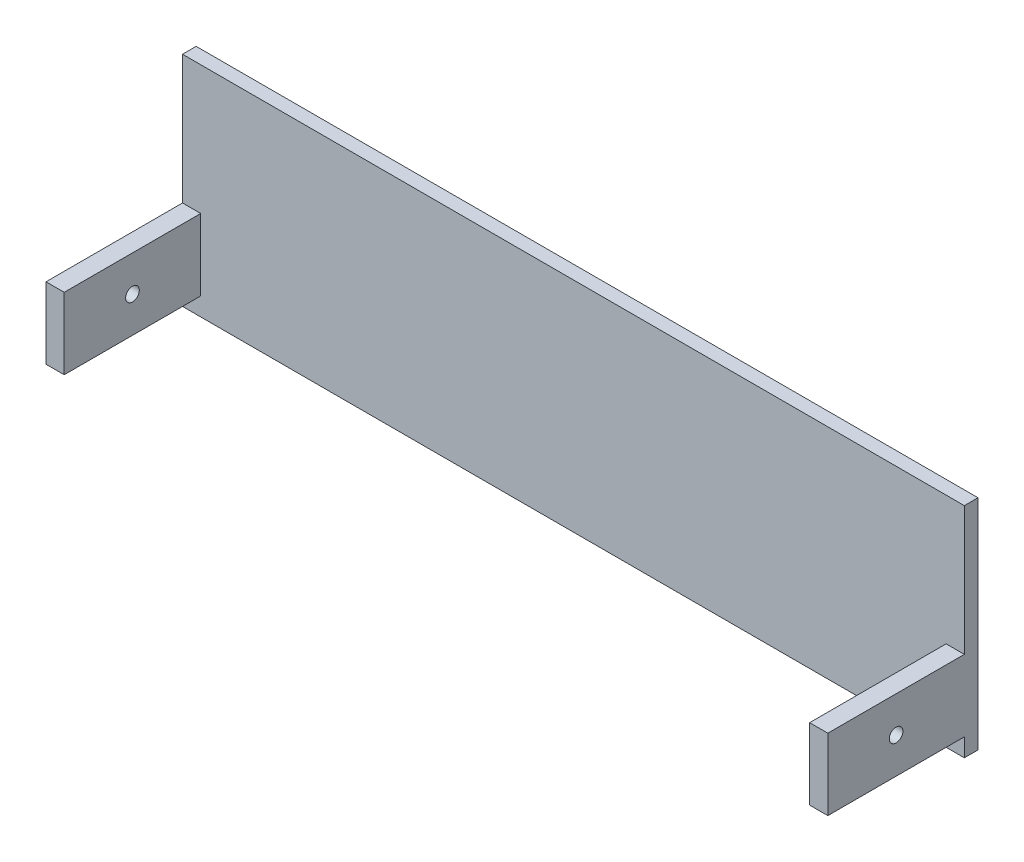
ISO-10303-21;
HEADER;
FILE_DESCRIPTION(('STEP AP214'),'2;1');
FILE_NAME('part.step','',(''),(''),'','','');
FILE_SCHEMA(('AUTOMOTIVE_DESIGN { 1 0 10303 214 1 1 1 1 }'));
ENDSEC;
DATA;
#1=APPLICATION_CONTEXT('core data for automotive mechanical design processes');
#2=APPLICATION_PROTOCOL_DEFINITION('international standard','automotive_design',2000,#1);
#3=PRODUCT_CONTEXT('',#1,'mechanical');
#4=PRODUCT('Part','Part','',(#3));
#5=PRODUCT_RELATED_PRODUCT_CATEGORY('part','',(#4));
#6=PRODUCT_DEFINITION_FORMATION('','',#4);
#7=PRODUCT_DEFINITION_CONTEXT('part definition',#1,'design');
#8=PRODUCT_DEFINITION('design','',#6,#7);
#9=PRODUCT_DEFINITION_SHAPE('','',#8);
#10=(LENGTH_UNIT() NAMED_UNIT(*) SI_UNIT(.MILLI.,.METRE.));
#11=(NAMED_UNIT(*) PLANE_ANGLE_UNIT() SI_UNIT($,.RADIAN.));
#12=(NAMED_UNIT(*) SI_UNIT($,.STERADIAN.) SOLID_ANGLE_UNIT());
#13=UNCERTAINTY_MEASURE_WITH_UNIT(LENGTH_MEASURE(1.E-05),#10,'distance_accuracy_value','');
#14=(GEOMETRIC_REPRESENTATION_CONTEXT(3) GLOBAL_UNCERTAINTY_ASSIGNED_CONTEXT((#13)) GLOBAL_UNIT_ASSIGNED_CONTEXT((#10,
#11,#12)) REPRESENTATION_CONTEXT('',''));
#15=CARTESIAN_POINT('',(0.,0.,0.));
#16=DIRECTION('',(0.,0.,1.));
#17=DIRECTION('',(1.,0.,0.));
#18=AXIS2_PLACEMENT_3D('',#15,#16,#17);
#19=CARTESIAN_POINT('',(0.,0.,3.));
#20=DIRECTION('',(0.,0.,1.));
#21=DIRECTION('',(1.,0.,0.));
#22=AXIS2_PLACEMENT_3D('',#19,#20,#21);
#23=PLANE('',#22);
#24=DIRECTION('',(0.,-1.,0.));
#25=VECTOR('',#24,1.);
#26=CARTESIAN_POINT('',(-4.,4.,3.));
#27=LINE('',#26,#25);
#28=CARTESIAN_POINT('',(-4.,19.6958737864084,3.));
#29=VERTEX_POINT('',#28);
#30=CARTESIAN_POINT('',(-4.,4.,3.));
#31=VERTEX_POINT('',#30);
#32=EDGE_CURVE('E139',#29,#31,#27,.T.);
#33=ORIENTED_EDGE('',*,*,#32,.F.);
#34=DIRECTION('',(-1.,0.,0.));
#35=VECTOR('',#34,1.);
#36=CARTESIAN_POINT('',(0.,19.6958737864084,3.));
#37=LINE('',#36,#35);
#38=CARTESIAN_POINT('',(0.,19.6958737864084,3.));
#39=VERTEX_POINT('',#38);
#40=EDGE_CURVE('E133',#39,#29,#37,.T.);
#41=ORIENTED_EDGE('',*,*,#40,.F.);
#42=DIRECTION('',(0.,-1.,0.));
#43=VECTOR('',#42,1.);
#44=CARTESIAN_POINT('',(0.,48.,3.));
#45=LINE('',#44,#43);
#46=CARTESIAN_POINT('',(0.,48.,3.));
#47=VERTEX_POINT('',#46);
#48=EDGE_CURVE('E136',#47,#39,#45,.T.);
#49=ORIENTED_EDGE('',*,*,#48,.F.);
#50=DIRECTION('',(-1.,0.,0.));
#51=VECTOR('',#50,1.);
#52=CARTESIAN_POINT('',(0.,48.,3.));
#53=LINE('',#52,#51);
#54=CARTESIAN_POINT('',(-171.8,48.,3.));
#55=VERTEX_POINT('',#54);
#56=EDGE_CURVE('E227',#47,#55,#53,.T.);
#57=ORIENTED_EDGE('',*,*,#56,.T.);
#58=DIRECTION('',(0.,-1.,0.));
#59=VECTOR('',#58,1.);
#60=CARTESIAN_POINT('',(-171.8,48.,3.));
#61=LINE('',#60,#59);
#62=CARTESIAN_POINT('',(-171.8,19.6958737864084,3.));
#63=VERTEX_POINT('',#62);
#64=EDGE_CURVE('E157',#55,#63,#61,.T.);
#65=ORIENTED_EDGE('',*,*,#64,.T.);
#66=CARTESIAN_POINT('',(-167.8,19.6958737864084,3.));
#67=VERTEX_POINT('',#66);
#68=EDGE_CURVE('E142',#67,#63,#37,.T.);
#69=ORIENTED_EDGE('',*,*,#68,.F.);
#70=DIRECTION('',(0.,1.,0.));
#71=VECTOR('',#70,1.);
#72=CARTESIAN_POINT('',(-167.8,4.,3.));
#73=LINE('',#72,#71);
#74=CARTESIAN_POINT('',(-167.8,4.,3.));
#75=VERTEX_POINT('',#74);
#76=EDGE_CURVE('E201',#75,#67,#73,.T.);
#77=ORIENTED_EDGE('',*,*,#76,.F.);
#78=DIRECTION('',(1.,0.,0.));
#79=VECTOR('',#78,1.);
#80=CARTESIAN_POINT('',(-171.8,4.,3.));
#81=LINE('',#80,#79);
#82=CARTESIAN_POINT('',(-171.8,4.,3.));
#83=VERTEX_POINT('',#82);
#84=EDGE_CURVE('E189',#83,#75,#81,.T.);
#85=ORIENTED_EDGE('',*,*,#84,.F.);
#86=DIRECTION('',(0.,-1.,0.));
#87=VECTOR('',#86,1.);
#88=CARTESIAN_POINT('',(-171.8,0.,3.));
#89=LINE('',#88,#87);
#90=CARTESIAN_POINT('',(-171.8,0.,3.));
#91=VERTEX_POINT('',#90);
#92=EDGE_CURVE('E231',#83,#91,#89,.T.);
#93=ORIENTED_EDGE('',*,*,#92,.T.);
#94=DIRECTION('',(1.,0.,0.));
#95=VECTOR('',#94,1.);
#96=CARTESIAN_POINT('',(0.,0.,3.));
#97=LINE('',#96,#95);
#98=CARTESIAN_POINT('',(0.,0.,3.));
#99=VERTEX_POINT('',#98);
#100=EDGE_CURVE('E234',#91,#99,#97,.T.);
#101=ORIENTED_EDGE('',*,*,#100,.T.);
#102=DIRECTION('',(0.,1.,0.));
#103=VECTOR('',#102,1.);
#104=CARTESIAN_POINT('',(0.,0.,3.));
#105=LINE('',#104,#103);
#106=CARTESIAN_POINT('',(0.,4.,3.));
#107=VERTEX_POINT('',#106);
#108=EDGE_CURVE('E223',#99,#107,#105,.T.);
#109=ORIENTED_EDGE('',*,*,#108,.T.);
#110=DIRECTION('',(1.,0.,0.));
#111=VECTOR('',#110,1.);
#112=CARTESIAN_POINT('',(0.,4.,3.));
#113=LINE('',#112,#111);
#114=EDGE_CURVE('E183',#31,#107,#113,.T.);
#115=ORIENTED_EDGE('',*,*,#114,.F.);
#116=EDGE_LOOP('',(#33,#41,#49,#57,#65,#69,#77,#85,#93,#101,#109,#115));
#117=FACE_BOUND('',#116,.T.);
#118=ADVANCED_FACE('F43',(#117),#23,.T.);
#119=CARTESIAN_POINT('',(0.,0.,3.));
#120=DIRECTION('',(-1.,0.,0.));
#121=DIRECTION('',(0.,0.,1.));
#122=AXIS2_PLACEMENT_3D('',#119,#120,#121);
#123=PLANE('',#122);
#124=CARTESIAN_POINT('',(0.,11.8479368932042,18.));
#125=DIRECTION('',(-1.,0.,0.));
#126=DIRECTION('',(0.,0.,1.));
#127=AXIS2_PLACEMENT_3D('',#124,#125,#126);
#128=CIRCLE('',#127,1.5);
#129=CARTESIAN_POINT('',(0.,11.8479368932042,19.5));
#130=VERTEX_POINT('',#129);
#131=EDGE_CURVE('E450',#130,#130,#128,.T.);
#132=ORIENTED_EDGE('',*,*,#131,.T.);
#133=EDGE_LOOP('',(#132));
#134=FACE_BOUND('',#133,.T.);
#135=DIRECTION('',(0.,0.,-1.));
#136=VECTOR('',#135,1.);
#137=CARTESIAN_POINT('',(0.,48.,3.));
#138=LINE('',#137,#136);
#139=CARTESIAN_POINT('',(0.,48.,0.));
#140=VERTEX_POINT('',#139);
#141=EDGE_CURVE('E11',#47,#140,#138,.T.);
#142=ORIENTED_EDGE('',*,*,#141,.F.);
#143=ORIENTED_EDGE('',*,*,#48,.T.);
#144=DIRECTION('',(0.,0.,1.));
#145=VECTOR('',#144,1.);
#146=CARTESIAN_POINT('',(0.,19.6958737864084,33.));
#147=LINE('',#146,#145);
#148=CARTESIAN_POINT('',(0.,19.6958737864084,33.));
#149=VERTEX_POINT('',#148);
#150=EDGE_CURVE('E145',#39,#149,#147,.T.);
#151=ORIENTED_EDGE('',*,*,#150,.T.);
#152=DIRECTION('',(0.,1.,0.));
#153=VECTOR('',#152,1.);
#154=CARTESIAN_POINT('',(0.,4.,33.));
#155=LINE('',#154,#153);
#156=CARTESIAN_POINT('',(0.,4.,33.));
#157=VERTEX_POINT('',#156);
#158=EDGE_CURVE('E186',#157,#149,#155,.T.);
#159=ORIENTED_EDGE('',*,*,#158,.F.);
#160=DIRECTION('',(0.,0.,-1.));
#161=VECTOR('',#160,1.);
#162=CARTESIAN_POINT('',(0.,4.,33.));
#163=LINE('',#162,#161);
#164=EDGE_CURVE('E178',#157,#107,#163,.T.);
#165=ORIENTED_EDGE('',*,*,#164,.T.);
#166=ORIENTED_EDGE('',*,*,#108,.F.);
#167=DIRECTION('',(0.,0.,-1.));
#168=VECTOR('',#167,1.);
#169=CARTESIAN_POINT('',(0.,0.,3.));
#170=LINE('',#169,#168);
#171=CARTESIAN_POINT('',(0.,0.,0.));
#172=VERTEX_POINT('',#171);
#173=EDGE_CURVE('E237',#99,#172,#170,.T.);
#174=ORIENTED_EDGE('',*,*,#173,.T.);
#175=DIRECTION('',(0.,1.,0.));
#176=VECTOR('',#175,1.);
#177=CARTESIAN_POINT('',(0.,0.,0.));
#178=LINE('',#177,#176);
#179=EDGE_CURVE('E222',#172,#140,#178,.T.);
#180=ORIENTED_EDGE('',*,*,#179,.T.);
#181=EDGE_LOOP('',(#142,#143,#151,#159,#165,#166,#174,#180));
#182=FACE_BOUND('',#181,.T.);
#183=ADVANCED_FACE('F45',(#134,#182),#123,.F.);
#184=CARTESIAN_POINT('',(0.,48.,3.));
#185=DIRECTION('',(0.,-1.,0.));
#186=DIRECTION('',(1.,0.,0.));
#187=AXIS2_PLACEMENT_3D('',#184,#185,#186);
#188=PLANE('',#187);
#189=DIRECTION('',(0.,0.,-1.));
#190=VECTOR('',#189,1.);
#191=CARTESIAN_POINT('',(-171.8,48.,3.));
#192=LINE('',#191,#190);
#193=CARTESIAN_POINT('',(-171.8,48.,0.));
#194=VERTEX_POINT('',#193);
#195=EDGE_CURVE('E53',#55,#194,#192,.T.);
#196=ORIENTED_EDGE('',*,*,#195,.F.);
#197=ORIENTED_EDGE('',*,*,#56,.F.);
#198=ORIENTED_EDGE('',*,*,#141,.T.);
#199=DIRECTION('',(-1.,0.,0.));
#200=VECTOR('',#199,1.);
#201=CARTESIAN_POINT('',(0.,48.,0.));
#202=LINE('',#201,#200);
#203=EDGE_CURVE('E240',#140,#194,#202,.T.);
#204=ORIENTED_EDGE('',*,*,#203,.T.);
#205=EDGE_LOOP('',(#196,#197,#198,#204));
#206=FACE_BOUND('',#205,.T.);
#207=ADVANCED_FACE('F265',(#206),#188,.F.);
#208=CARTESIAN_POINT('',(-171.8,0.,3.));
#209=DIRECTION('',(1.,0.,0.));
#210=DIRECTION('',(0.,0.,-1.));
#211=AXIS2_PLACEMENT_3D('',#208,#209,#210);
#212=PLANE('',#211);
#213=CARTESIAN_POINT('',(-171.8,11.8479368932042,18.));
#214=DIRECTION('',(-1.,0.,0.));
#215=DIRECTION('',(0.,0.,1.));
#216=AXIS2_PLACEMENT_3D('',#213,#214,#215);
#217=CIRCLE('',#216,1.5);
#218=CARTESIAN_POINT('',(-171.8,11.8479368932042,19.5));
#219=VERTEX_POINT('',#218);
#220=EDGE_CURVE('E454',#219,#219,#217,.T.);
#221=ORIENTED_EDGE('',*,*,#220,.F.);
#222=EDGE_LOOP('',(#221));
#223=FACE_BOUND('',#222,.T.);
#224=DIRECTION('',(0.,0.,1.));
#225=VECTOR('',#224,1.);
#226=CARTESIAN_POINT('',(-171.8,19.6958737864084,33.));
#227=LINE('',#226,#225);
#228=CARTESIAN_POINT('',(-171.8,19.6958737864084,33.));
#229=VERTEX_POINT('',#228);
#230=EDGE_CURVE('E60',#63,#229,#227,.T.);
#231=ORIENTED_EDGE('',*,*,#230,.F.);
#232=ORIENTED_EDGE('',*,*,#64,.F.);
#233=ORIENTED_EDGE('',*,*,#195,.T.);
#234=DIRECTION('',(0.,-1.,0.));
#235=VECTOR('',#234,1.);
#236=CARTESIAN_POINT('',(-171.8,0.,0.));
#237=LINE('',#236,#235);
#238=CARTESIAN_POINT('',(-171.8,0.,0.));
#239=VERTEX_POINT('',#238);
#240=EDGE_CURVE('E244',#194,#239,#237,.T.);
#241=ORIENTED_EDGE('',*,*,#240,.T.);
#242=DIRECTION('',(0.,0.,-1.));
#243=VECTOR('',#242,1.);
#244=CARTESIAN_POINT('',(-171.8,0.,3.));
#245=LINE('',#244,#243);
#246=EDGE_CURVE('E252',#91,#239,#245,.T.);
#247=ORIENTED_EDGE('',*,*,#246,.F.);
#248=ORIENTED_EDGE('',*,*,#92,.F.);
#249=DIRECTION('',(0.,0.,-1.));
#250=VECTOR('',#249,1.);
#251=CARTESIAN_POINT('',(-171.8,4.,33.));
#252=LINE('',#251,#250);
#253=CARTESIAN_POINT('',(-171.8,4.,33.));
#254=VERTEX_POINT('',#253);
#255=EDGE_CURVE('E218',#254,#83,#252,.T.);
#256=ORIENTED_EDGE('',*,*,#255,.F.);
#257=DIRECTION('',(0.,-1.,0.));
#258=VECTOR('',#257,1.);
#259=CARTESIAN_POINT('',(-171.8,4.,33.));
#260=LINE('',#259,#258);
#261=EDGE_CURVE('E197',#229,#254,#260,.T.);
#262=ORIENTED_EDGE('',*,*,#261,.F.);
#263=EDGE_LOOP('',(#231,#232,#233,#241,#247,#248,#256,#262));
#264=FACE_BOUND('',#263,.T.);
#265=ADVANCED_FACE('F260',(#223,#264),#212,.F.);
#266=CARTESIAN_POINT('',(0.,0.,3.));
#267=DIRECTION('',(0.,1.,0.));
#268=DIRECTION('',(0.,0.,1.));
#269=AXIS2_PLACEMENT_3D('',#266,#267,#268);
#270=PLANE('',#269);
#271=DIRECTION('',(1.,0.,0.));
#272=VECTOR('',#271,1.);
#273=CARTESIAN_POINT('',(0.,0.,0.));
#274=LINE('',#273,#272);
#275=EDGE_CURVE('E228',#239,#172,#274,.T.);
#276=ORIENTED_EDGE('',*,*,#275,.T.);
#277=ORIENTED_EDGE('',*,*,#173,.F.);
#278=ORIENTED_EDGE('',*,*,#100,.F.);
#279=ORIENTED_EDGE('',*,*,#246,.T.);
#280=EDGE_LOOP('',(#276,#277,#278,#279));
#281=FACE_BOUND('',#280,.T.);
#282=ADVANCED_FACE('F272',(#281),#270,.F.);
#283=CARTESIAN_POINT('',(0.,0.,0.));
#284=DIRECTION('',(0.,0.,1.));
#285=DIRECTION('',(1.,0.,0.));
#286=AXIS2_PLACEMENT_3D('',#283,#284,#285);
#287=PLANE('',#286);
#288=ORIENTED_EDGE('',*,*,#179,.F.);
#289=ORIENTED_EDGE('',*,*,#275,.F.);
#290=ORIENTED_EDGE('',*,*,#240,.F.);
#291=ORIENTED_EDGE('',*,*,#203,.F.);
#292=EDGE_LOOP('',(#288,#289,#290,#291));
#293=FACE_BOUND('',#292,.T.);
#294=ADVANCED_FACE('F269',(#293),#287,.F.);
#295=CARTESIAN_POINT('',(-171.8,4.,33.));
#296=DIRECTION('',(0.,1.,0.));
#297=DIRECTION('',(-1.,0.,0.));
#298=AXIS2_PLACEMENT_3D('',#295,#296,#297);
#299=PLANE('',#298);
#300=ORIENTED_EDGE('',*,*,#84,.T.);
#301=DIRECTION('',(0.,0.,-1.));
#302=VECTOR('',#301,1.);
#303=CARTESIAN_POINT('',(-167.8,4.,33.));
#304=LINE('',#303,#302);
#305=CARTESIAN_POINT('',(-167.8,4.,33.));
#306=VERTEX_POINT('',#305);
#307=EDGE_CURVE('E208',#306,#75,#304,.T.);
#308=ORIENTED_EDGE('',*,*,#307,.F.);
#309=DIRECTION('',(1.,0.,0.));
#310=VECTOR('',#309,1.);
#311=CARTESIAN_POINT('',(-171.8,4.,33.));
#312=LINE('',#311,#310);
#313=EDGE_CURVE('E200',#254,#306,#312,.T.);
#314=ORIENTED_EDGE('',*,*,#313,.F.);
#315=ORIENTED_EDGE('',*,*,#255,.T.);
#316=EDGE_LOOP('',(#300,#308,#314,#315));
#317=FACE_BOUND('',#316,.T.);
#318=ADVANCED_FACE('F281',(#317),#299,.F.);
#319=CARTESIAN_POINT('',(-167.8,4.,33.));
#320=DIRECTION('',(-1.,0.,0.));
#321=DIRECTION('',(0.,0.,1.));
#322=AXIS2_PLACEMENT_3D('',#319,#320,#321);
#323=PLANE('',#322);
#324=CARTESIAN_POINT('',(-167.8,11.8479368932042,18.));
#325=DIRECTION('',(-1.,0.,0.));
#326=DIRECTION('',(0.,0.,1.));
#327=AXIS2_PLACEMENT_3D('',#324,#325,#326);
#328=CIRCLE('',#327,1.5);
#329=CARTESIAN_POINT('',(-167.8,11.8479368932042,19.5));
#330=VERTEX_POINT('',#329);
#331=EDGE_CURVE('E160',#330,#330,#328,.T.);
#332=ORIENTED_EDGE('',*,*,#331,.T.);
#333=EDGE_LOOP('',(#332));
#334=FACE_BOUND('',#333,.T.);
#335=ORIENTED_EDGE('',*,*,#76,.T.);
#336=DIRECTION('',(0.,0.,1.));
#337=VECTOR('',#336,1.);
#338=CARTESIAN_POINT('',(-167.8,19.6958737864084,33.));
#339=LINE('',#338,#337);
#340=CARTESIAN_POINT('',(-167.8,19.6958737864084,33.));
#341=VERTEX_POINT('',#340);
#342=EDGE_CURVE('E170',#67,#341,#339,.T.);
#343=ORIENTED_EDGE('',*,*,#342,.T.);
#344=DIRECTION('',(0.,1.,0.));
#345=VECTOR('',#344,1.);
#346=CARTESIAN_POINT('',(-167.8,4.,33.));
#347=LINE('',#346,#345);
#348=EDGE_CURVE('E204',#306,#341,#347,.T.);
#349=ORIENTED_EDGE('',*,*,#348,.F.);
#350=ORIENTED_EDGE('',*,*,#307,.T.);
#351=EDGE_LOOP('',(#335,#343,#349,#350));
#352=FACE_BOUND('',#351,.T.);
#353=ADVANCED_FACE('F291',(#334,#352),#323,.F.);
#354=CARTESIAN_POINT('',(0.,0.,33.));
#355=DIRECTION('',(0.,0.,-1.));
#356=DIRECTION('',(-1.,0.,0.));
#357=AXIS2_PLACEMENT_3D('',#354,#355,#356);
#358=PLANE('',#357);
#359=ORIENTED_EDGE('',*,*,#348,.T.);
#360=DIRECTION('',(-1.,0.,0.));
#361=VECTOR('',#360,1.);
#362=CARTESIAN_POINT('',(0.,19.6958737864084,33.));
#363=LINE('',#362,#361);
#364=EDGE_CURVE('E141',#341,#229,#363,.T.);
#365=ORIENTED_EDGE('',*,*,#364,.T.);
#366=ORIENTED_EDGE('',*,*,#261,.T.);
#367=ORIENTED_EDGE('',*,*,#313,.T.);
#368=EDGE_LOOP('',(#359,#365,#366,#367));
#369=FACE_BOUND('',#368,.T.);
#370=ADVANCED_FACE('F285',(#369),#358,.F.);
#371=CARTESIAN_POINT('',(-4.,4.,33.));
#372=DIRECTION('',(1.,0.,0.));
#373=DIRECTION('',(0.,0.,-1.));
#374=AXIS2_PLACEMENT_3D('',#371,#372,#373);
#375=PLANE('',#374);
#376=CARTESIAN_POINT('',(-4.,11.8479368932042,18.));
#377=DIRECTION('',(1.,0.,0.));
#378=DIRECTION('',(0.,0.,-1.));
#379=AXIS2_PLACEMENT_3D('',#376,#377,#378);
#380=CIRCLE('',#379,1.5);
#381=CARTESIAN_POINT('',(-4.,11.8479368932042,16.5));
#382=VERTEX_POINT('',#381);
#383=EDGE_CURVE('E47',#382,#382,#380,.T.);
#384=ORIENTED_EDGE('',*,*,#383,.T.);
#385=EDGE_LOOP('',(#384));
#386=FACE_BOUND('',#385,.T.);
#387=DIRECTION('',(0.,-1.,0.));
#388=VECTOR('',#387,1.);
#389=CARTESIAN_POINT('',(-4.,4.,33.));
#390=LINE('',#389,#388);
#391=CARTESIAN_POINT('',(-4.,19.6958737864084,33.));
#392=VERTEX_POINT('',#391);
#393=CARTESIAN_POINT('',(-4.,4.,33.));
#394=VERTEX_POINT('',#393);
#395=EDGE_CURVE('E192',#392,#394,#390,.T.);
#396=ORIENTED_EDGE('',*,*,#395,.F.);
#397=DIRECTION('',(0.,0.,-1.));
#398=VECTOR('',#397,1.);
#399=CARTESIAN_POINT('',(-4.,19.6958737864084,33.));
#400=LINE('',#399,#398);
#401=EDGE_CURVE('E68',#392,#29,#400,.T.);
#402=ORIENTED_EDGE('',*,*,#401,.T.);
#403=ORIENTED_EDGE('',*,*,#32,.T.);
#404=DIRECTION('',(0.,0.,-1.));
#405=VECTOR('',#404,1.);
#406=CARTESIAN_POINT('',(-4.,4.,33.));
#407=LINE('',#406,#405);
#408=EDGE_CURVE('E174',#394,#31,#407,.T.);
#409=ORIENTED_EDGE('',*,*,#408,.F.);
#410=EDGE_LOOP('',(#396,#402,#403,#409));
#411=FACE_BOUND('',#410,.T.);
#412=ADVANCED_FACE('F299',(#386,#411),#375,.F.);
#413=CARTESIAN_POINT('',(0.,4.,33.));
#414=DIRECTION('',(0.,1.,0.));
#415=DIRECTION('',(-1.,0.,0.));
#416=AXIS2_PLACEMENT_3D('',#413,#414,#415);
#417=PLANE('',#416);
#418=ORIENTED_EDGE('',*,*,#114,.T.);
#419=ORIENTED_EDGE('',*,*,#164,.F.);
#420=DIRECTION('',(1.,0.,0.));
#421=VECTOR('',#420,1.);
#422=CARTESIAN_POINT('',(0.,4.,33.));
#423=LINE('',#422,#421);
#424=EDGE_CURVE('E182',#394,#157,#423,.T.);
#425=ORIENTED_EDGE('',*,*,#424,.F.);
#426=ORIENTED_EDGE('',*,*,#408,.T.);
#427=EDGE_LOOP('',(#418,#419,#425,#426));
#428=FACE_BOUND('',#427,.T.);
#429=ADVANCED_FACE('F345',(#428),#417,.F.);
#430=CARTESIAN_POINT('',(0.,0.,33.));
#431=DIRECTION('',(0.,0.,1.));
#432=DIRECTION('',(1.,0.,0.));
#433=AXIS2_PLACEMENT_3D('',#430,#431,#432);
#434=PLANE('',#433);
#435=EDGE_CURVE('E147',#149,#392,#363,.T.);
#436=ORIENTED_EDGE('',*,*,#435,.T.);
#437=ORIENTED_EDGE('',*,*,#395,.T.);
#438=ORIENTED_EDGE('',*,*,#424,.T.);
#439=ORIENTED_EDGE('',*,*,#158,.T.);
#440=EDGE_LOOP('',(#436,#437,#438,#439));
#441=FACE_BOUND('',#440,.T.);
#442=ADVANCED_FACE('F349',(#441),#434,.T.);
#443=CARTESIAN_POINT('',(0.,19.6958737864084,33.));
#444=DIRECTION('',(0.,-1.,0.));
#445=DIRECTION('',(0.,0.,-1.));
#446=AXIS2_PLACEMENT_3D('',#443,#444,#445);
#447=PLANE('',#446);
#448=ORIENTED_EDGE('',*,*,#435,.F.);
#449=ORIENTED_EDGE('',*,*,#150,.F.);
#450=ORIENTED_EDGE('',*,*,#40,.T.);
#451=ORIENTED_EDGE('',*,*,#401,.F.);
#452=EDGE_LOOP('',(#448,#449,#450,#451));
#453=FACE_BOUND('',#452,.T.);
#454=ADVANCED_FACE('F146',(#453),#447,.F.);
#455=ORIENTED_EDGE('',*,*,#68,.T.);
#456=ORIENTED_EDGE('',*,*,#230,.T.);
#457=ORIENTED_EDGE('',*,*,#364,.F.);
#458=ORIENTED_EDGE('',*,*,#342,.F.);
#459=EDGE_LOOP('',(#455,#456,#457,#458));
#460=FACE_BOUND('',#459,.T.);
#461=ADVANCED_FACE('F289',(#460),#447,.F.);
#462=CARTESIAN_POINT('',(0.,11.8479368932042,18.));
#463=DIRECTION('',(-1.,0.,0.));
#464=DIRECTION('',(0.,0.,1.));
#465=AXIS2_PLACEMENT_3D('',#462,#463,#464);
#466=CYLINDRICAL_SURFACE('',#465,1.5);
#467=ORIENTED_EDGE('',*,*,#131,.F.);
#468=EDGE_LOOP('',(#467));
#469=FACE_BOUND('',#468,.T.);
#470=ORIENTED_EDGE('',*,*,#383,.F.);
#471=EDGE_LOOP('',(#470));
#472=FACE_BOUND('',#471,.T.);
#473=ADVANCED_FACE('F388',(#469,#472),#466,.F.);
#474=ORIENTED_EDGE('',*,*,#220,.T.);
#475=EDGE_LOOP('',(#474));
#476=FACE_BOUND('',#475,.T.);
#477=ORIENTED_EDGE('',*,*,#331,.F.);
#478=EDGE_LOOP('',(#477));
#479=FACE_BOUND('',#478,.T.);
#480=ADVANCED_FACE('F397',(#476,#479),#466,.F.);
#481=CLOSED_SHELL('',(#118,#183,#207,#265,#282,#294,#318,#353,#370,#412,#429,#442,#454,#461,
#473,#480));
#482=MANIFOLD_SOLID_BREP('B2',#481);
#483=ADVANCED_BREP_SHAPE_REPRESENTATION('',(#18,#482),#14);
#484=SHAPE_DEFINITION_REPRESENTATION(#9,#483);
ENDSEC;
END-ISO-10303-21;
